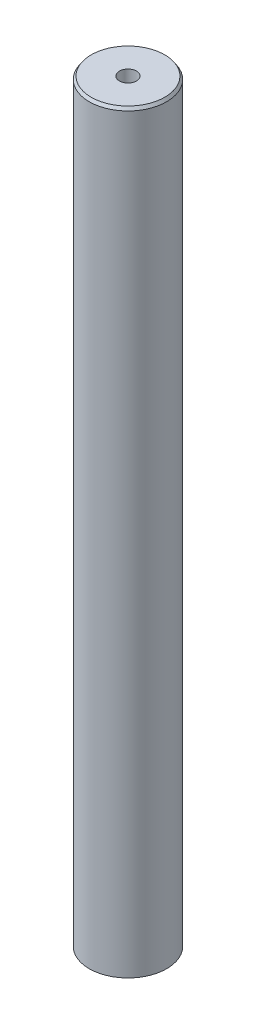
ISO-10303-21;
HEADER;
FILE_DESCRIPTION(('STEP AP214'),'2;1');
FILE_NAME('part.step','',(''),(''),'','','');
FILE_SCHEMA(('AUTOMOTIVE_DESIGN { 1 0 10303 214 1 1 1 1 }'));
ENDSEC;
DATA;
#1=APPLICATION_CONTEXT('core data for automotive mechanical design processes');
#2=APPLICATION_PROTOCOL_DEFINITION('international standard','automotive_design',2000,#1);
#3=PRODUCT_CONTEXT('',#1,'mechanical');
#4=PRODUCT('Part','Part','',(#3));
#5=PRODUCT_RELATED_PRODUCT_CATEGORY('part','',(#4));
#6=PRODUCT_DEFINITION_FORMATION('','',#4);
#7=PRODUCT_DEFINITION_CONTEXT('part definition',#1,'design');
#8=PRODUCT_DEFINITION('design','',#6,#7);
#9=PRODUCT_DEFINITION_SHAPE('','',#8);
#10=(LENGTH_UNIT() NAMED_UNIT(*) SI_UNIT(.MILLI.,.METRE.));
#11=(NAMED_UNIT(*) PLANE_ANGLE_UNIT() SI_UNIT($,.RADIAN.));
#12=(NAMED_UNIT(*) SI_UNIT($,.STERADIAN.) SOLID_ANGLE_UNIT());
#13=UNCERTAINTY_MEASURE_WITH_UNIT(LENGTH_MEASURE(1.E-05),#10,'distance_accuracy_value','');
#14=(GEOMETRIC_REPRESENTATION_CONTEXT(3) GLOBAL_UNCERTAINTY_ASSIGNED_CONTEXT((#13)) GLOBAL_UNIT_ASSIGNED_CONTEXT((#10,
#11,#12)) REPRESENTATION_CONTEXT('',''));
#15=CARTESIAN_POINT('',(0.,0.,0.));
#16=DIRECTION('',(0.,0.,1.));
#17=DIRECTION('',(1.,0.,0.));
#18=AXIS2_PLACEMENT_3D('',#15,#16,#17);
#19=CARTESIAN_POINT('',(0.,97.6320488817782,0.));
#20=DIRECTION('',(0.,-1.,0.));
#21=DIRECTION('',(0.,0.,-1.));
#22=AXIS2_PLACEMENT_3D('',#19,#20,#21);
#23=CYLINDRICAL_SURFACE('',#22,5.);
#24=CARTESIAN_POINT('',(0.,97.2534810656058,0.));
#25=DIRECTION('',(0.,1.,0.));
#26=DIRECTION('',(0.,0.,1.));
#27=AXIS2_PLACEMENT_3D('',#24,#25,#26);
#28=CIRCLE('',#27,5.);
#29=CARTESIAN_POINT('',(0.,97.2534810656058,5.));
#30=VERTEX_POINT('',#29);
#31=EDGE_CURVE('E50',#30,#30,#28,.F.);
#32=ORIENTED_EDGE('',*,*,#31,.T.);
#33=EDGE_LOOP('',(#32));
#34=FACE_BOUND('',#33,.T.);
#35=CARTESIAN_POINT('',(0.,0.248420290129392,0.));
#36=DIRECTION('',(0.,1.,0.));
#37=DIRECTION('',(0.,0.,1.));
#38=AXIS2_PLACEMENT_3D('',#35,#36,#37);
#39=CIRCLE('',#38,5.);
#40=CARTESIAN_POINT('',(0.,0.248420290129392,5.));
#41=VERTEX_POINT('',#40);
#42=EDGE_CURVE('E51',#41,#41,#39,.T.);
#43=ORIENTED_EDGE('',*,*,#42,.T.);
#44=EDGE_LOOP('',(#43));
#45=FACE_BOUND('',#44,.T.);
#46=ADVANCED_FACE('F39',(#34,#45),#23,.T.);
#47=CARTESIAN_POINT('',(0.,97.6320488817782,0.));
#48=DIRECTION('',(0.,1.,0.));
#49=DIRECTION('',(0.,0.,1.));
#50=AXIS2_PLACEMENT_3D('',#47,#48,#49);
#51=PLANE('',#50);
#52=CARTESIAN_POINT('',(0.,97.6320488817782,0.));
#53=DIRECTION('',(0.,1.,0.));
#54=DIRECTION('',(0.,0.,1.));
#55=AXIS2_PLACEMENT_3D('',#52,#53,#54);
#56=CIRCLE('',#55,4.75157970987061);
#57=CARTESIAN_POINT('',(0.,97.6320488817782,4.75157970987061));
#58=VERTEX_POINT('',#57);
#59=EDGE_CURVE('E54',#58,#58,#56,.T.);
#60=ORIENTED_EDGE('',*,*,#59,.T.);
#61=EDGE_LOOP('',(#60));
#62=FACE_BOUND('',#61,.T.);
#63=CARTESIAN_POINT('',(0.,97.6320488817782,0.));
#64=DIRECTION('',(0.,1.,0.));
#65=DIRECTION('',(0.,0.,1.));
#66=AXIS2_PLACEMENT_3D('',#63,#64,#65);
#67=CIRCLE('',#66,1.10761515333257);
#68=CARTESIAN_POINT('',(0.,97.6320488817782,1.10761515333257));
#69=VERTEX_POINT('',#68);
#70=EDGE_CURVE('E58',#69,#69,#67,.T.);
#71=ORIENTED_EDGE('',*,*,#70,.F.);
#72=EDGE_LOOP('',(#71));
#73=FACE_BOUND('',#72,.T.);
#74=ADVANCED_FACE('F69',(#62,#73),#51,.T.);
#75=CARTESIAN_POINT('',(0.,0.,0.));
#76=DIRECTION('',(0.,1.,0.));
#77=DIRECTION('',(0.,0.,1.));
#78=AXIS2_PLACEMENT_3D('',#75,#76,#77);
#79=PLANE('',#78);
#80=CARTESIAN_POINT('',(0.,0.,0.));
#81=DIRECTION('',(0.,1.,0.));
#82=DIRECTION('',(0.,0.,1.));
#83=AXIS2_PLACEMENT_3D('',#80,#81,#82);
#84=CIRCLE('',#83,4.62143218382752);
#85=CARTESIAN_POINT('',(0.,0.,4.62143218382752));
#86=VERTEX_POINT('',#85);
#87=EDGE_CURVE('E10',#86,#86,#84,.F.);
#88=ORIENTED_EDGE('',*,*,#87,.T.);
#89=EDGE_LOOP('',(#88));
#90=FACE_BOUND('',#89,.T.);
#91=CARTESIAN_POINT('',(0.,0.,0.));
#92=DIRECTION('',(0.,1.,0.));
#93=DIRECTION('',(0.,0.,1.));
#94=AXIS2_PLACEMENT_3D('',#91,#92,#93);
#95=CIRCLE('',#94,1.10761515333257);
#96=CARTESIAN_POINT('',(0.,0.,1.10761515333257));
#97=VERTEX_POINT('',#96);
#98=EDGE_CURVE('E63',#97,#97,#95,.T.);
#99=ORIENTED_EDGE('',*,*,#98,.T.);
#100=EDGE_LOOP('',(#99));
#101=FACE_BOUND('',#100,.T.);
#102=ADVANCED_FACE('F75',(#90,#101),#79,.F.);
#103=CARTESIAN_POINT('',(0.,97.6320488817782,0.));
#104=DIRECTION('',(0.,-1.,0.));
#105=DIRECTION('',(0.,0.,-1.));
#106=AXIS2_PLACEMENT_3D('',#103,#104,#105);
#107=CYLINDRICAL_SURFACE('',#106,1.10761515333257);
#108=ORIENTED_EDGE('',*,*,#70,.T.);
#109=EDGE_LOOP('',(#108));
#110=FACE_BOUND('',#109,.T.);
#111=ORIENTED_EDGE('',*,*,#98,.F.);
#112=EDGE_LOOP('',(#111));
#113=FACE_BOUND('',#112,.T.);
#114=ADVANCED_FACE('F70',(#110,#113),#107,.F.);
#115=CARTESIAN_POINT('',(0.,97.6320488817782,0.));
#116=DIRECTION('',(0.,-1.,0.));
#117=DIRECTION('',(0.,0.,-1.));
#118=AXIS2_PLACEMENT_3D('',#115,#116,#117);
#119=CONICAL_SURFACE('',#118,4.75157970987061,0.580728954364795);
#120=ORIENTED_EDGE('',*,*,#31,.F.);
#121=EDGE_LOOP('',(#120));
#122=FACE_BOUND('',#121,.T.);
#123=ORIENTED_EDGE('',*,*,#59,.F.);
#124=EDGE_LOOP('',(#123));
#125=FACE_BOUND('',#124,.T.);
#126=ADVANCED_FACE('F81',(#122,#125),#119,.T.);
#127=CARTESIAN_POINT('',(0.,0.248420290129392,0.));
#128=DIRECTION('',(0.,1.,0.));
#129=DIRECTION('',(0.,0.,1.));
#130=AXIS2_PLACEMENT_3D('',#127,#128,#129);
#131=CONICAL_SURFACE('',#130,5.,0.990067372430118);
#132=ORIENTED_EDGE('',*,*,#87,.F.);
#133=EDGE_LOOP('',(#132));
#134=FACE_BOUND('',#133,.T.);
#135=ORIENTED_EDGE('',*,*,#42,.F.);
#136=EDGE_LOOP('',(#135));
#137=FACE_BOUND('',#136,.T.);
#138=ADVANCED_FACE('F45',(#134,#137),#131,.T.);
#139=CLOSED_SHELL('',(#46,#74,#102,#114,#126,#138));
#140=MANIFOLD_SOLID_BREP('B2',#139);
#141=ADVANCED_BREP_SHAPE_REPRESENTATION('',(#18,#140),#14);
#142=SHAPE_DEFINITION_REPRESENTATION(#9,#141);
ENDSEC;
END-ISO-10303-21;
